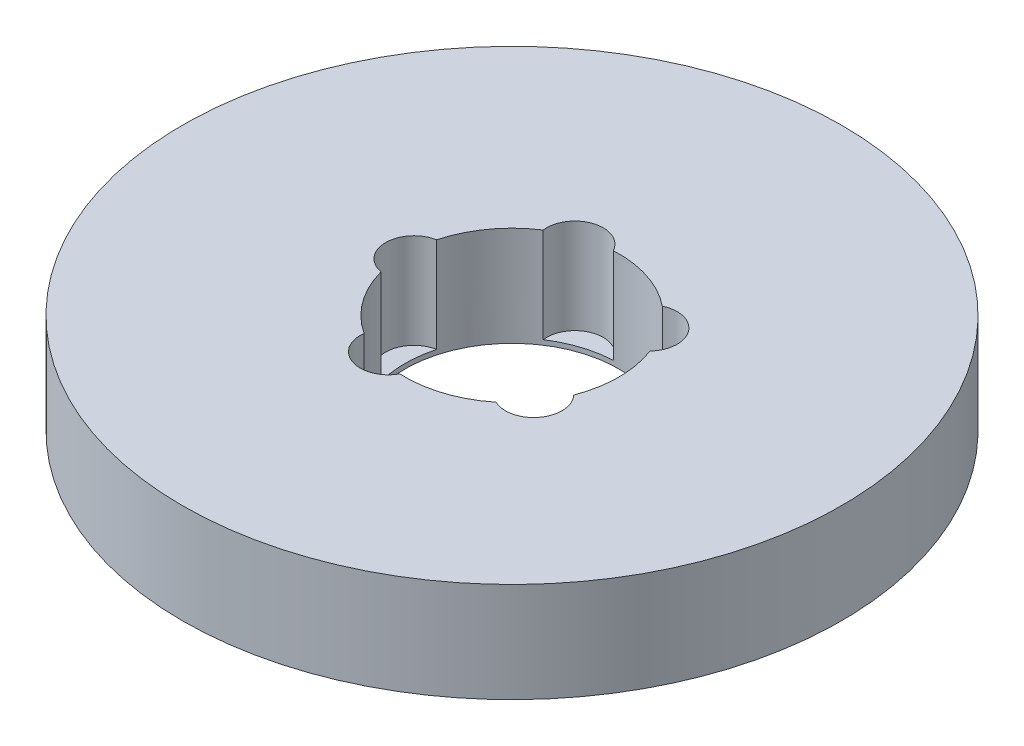
ISO-10303-21;
HEADER;
FILE_DESCRIPTION(('STEP AP214'),'2;1');
FILE_NAME('part.step','',(''),(''),'','','');
FILE_SCHEMA(('AUTOMOTIVE_DESIGN { 1 0 10303 214 1 1 1 1 }'));
ENDSEC;
DATA;
#1=APPLICATION_CONTEXT('core data for automotive mechanical design processes');
#2=APPLICATION_PROTOCOL_DEFINITION('international standard','automotive_design',2000,#1);
#3=PRODUCT_CONTEXT('',#1,'mechanical');
#4=PRODUCT('Part','Part','',(#3));
#5=PRODUCT_RELATED_PRODUCT_CATEGORY('part','',(#4));
#6=PRODUCT_DEFINITION_FORMATION('','',#4);
#7=PRODUCT_DEFINITION_CONTEXT('part definition',#1,'design');
#8=PRODUCT_DEFINITION('design','',#6,#7);
#9=PRODUCT_DEFINITION_SHAPE('','',#8);
#10=(LENGTH_UNIT() NAMED_UNIT(*) SI_UNIT(.MILLI.,.METRE.));
#11=(NAMED_UNIT(*) PLANE_ANGLE_UNIT() SI_UNIT($,.RADIAN.));
#12=(NAMED_UNIT(*) SI_UNIT($,.STERADIAN.) SOLID_ANGLE_UNIT());
#13=UNCERTAINTY_MEASURE_WITH_UNIT(LENGTH_MEASURE(1.E-05),#10,'distance_accuracy_value','');
#14=(GEOMETRIC_REPRESENTATION_CONTEXT(3) GLOBAL_UNCERTAINTY_ASSIGNED_CONTEXT((#13)) GLOBAL_UNIT_ASSIGNED_CONTEXT((#10,
#11,#12)) REPRESENTATION_CONTEXT('',''));
#15=CARTESIAN_POINT('',(0.,0.,0.));
#16=DIRECTION('',(0.,0.,1.));
#17=DIRECTION('',(1.,0.,0.));
#18=AXIS2_PLACEMENT_3D('',#15,#16,#17);
#19=CARTESIAN_POINT('',(0.,28.,0.));
#20=DIRECTION('',(0.,-1.,0.));
#21=DIRECTION('',(0.,0.,-1.));
#22=AXIS2_PLACEMENT_3D('',#19,#20,#21);
#23=CYLINDRICAL_SURFACE('',#22,92.5);
#24=CARTESIAN_POINT('',(0.,28.,0.));
#25=DIRECTION('',(0.,1.,0.));
#26=DIRECTION('',(0.,0.,1.));
#27=AXIS2_PLACEMENT_3D('',#24,#25,#26);
#28=CIRCLE('',#27,92.5);
#29=CARTESIAN_POINT('',(0.,28.,92.5));
#30=VERTEX_POINT('',#29);
#31=EDGE_CURVE('E151',#30,#30,#28,.T.);
#32=ORIENTED_EDGE('',*,*,#31,.F.);
#33=EDGE_LOOP('',(#32));
#34=FACE_BOUND('',#33,.T.);
#35=CARTESIAN_POINT('',(0.,0.,0.));
#36=DIRECTION('',(0.,1.,0.));
#37=DIRECTION('',(0.,0.,1.));
#38=AXIS2_PLACEMENT_3D('',#35,#36,#37);
#39=CIRCLE('',#38,92.5);
#40=CARTESIAN_POINT('',(0.,0.,92.5));
#41=VERTEX_POINT('',#40);
#42=EDGE_CURVE('E150',#41,#41,#39,.T.);
#43=ORIENTED_EDGE('',*,*,#42,.T.);
#44=EDGE_LOOP('',(#43));
#45=FACE_BOUND('',#44,.T.);
#46=ADVANCED_FACE('F39',(#34,#45),#23,.T.);
#47=CARTESIAN_POINT('',(0.,28.,0.));
#48=DIRECTION('',(0.,1.,0.));
#49=DIRECTION('',(0.,0.,1.));
#50=AXIS2_PLACEMENT_3D('',#47,#48,#49);
#51=PLANE('',#50);
#52=CARTESIAN_POINT('',(-8.50118758878569,28.,-26.1639650884433));
#53=DIRECTION('',(0.,1.,0.));
#54=DIRECTION('',(-0.95105651629515,0.,0.309016994374958));
#55=AXIS2_PLACEMENT_3D('',#52,#53,#54);
#56=CIRCLE('',#55,7.94232106861222);
#57=CARTESIAN_POINT('',(-1.525406769739,28.,-29.9611938044337));
#58=VERTEX_POINT('',#57);
#59=CARTESIAN_POINT('',(-16.3766678592699,28.,-25.1357265625475));
#60=VERTEX_POINT('',#59);
#61=EDGE_CURVE('E196',#58,#60,#56,.T.);
#62=ORIENTED_EDGE('',*,*,#61,.F.);
#63=CARTESIAN_POINT('',(0.,28.,0.));
#64=DIRECTION('',(0.,1.,0.));
#65=DIRECTION('',(0.,0.,1.));
#66=AXIS2_PLACEMENT_3D('',#63,#64,#65);
#67=CIRCLE('',#66,30.);
#68=CARTESIAN_POINT('',(18.8448278593757,28.,-23.3425033565489));
#69=VERTEX_POINT('',#68);
#70=EDGE_CURVE('E156',#69,#58,#67,.T.);
#71=ORIENTED_EDGE('',*,*,#70,.F.);
#72=CARTESIAN_POINT('',(22.2563980521788,28.,-16.1702197051239));
#73=DIRECTION('',(0.,1.,0.));
#74=DIRECTION('',(-0.58778525229248,0.,-0.809016994374942));
#75=AXIS2_PLACEMENT_3D('',#72,#73,#74);
#76=CIRCLE('',#75,7.94232106861222);
#77=CARTESIAN_POINT('',(28.0234119885047,28.,-10.7092661056923));
#78=VERTEX_POINT('',#77);
#79=EDGE_CURVE('E254',#78,#69,#76,.T.);
#80=ORIENTED_EDGE('',*,*,#79,.F.);
#81=CARTESIAN_POINT('',(28.0234119885049,28.,10.7092661056919));
#82=VERTEX_POINT('',#81);
#83=EDGE_CURVE('E153',#82,#78,#67,.T.);
#84=ORIENTED_EDGE('',*,*,#83,.F.);
#85=CARTESIAN_POINT('',(22.256398052179,28.,16.1702197051236));
#86=DIRECTION('',(0.,1.,0.));
#87=DIRECTION('',(0.587785252292469,0.,-0.809016994374951));
#88=AXIS2_PLACEMENT_3D('',#85,#86,#87);
#89=CIRCLE('',#88,7.94232106861222);
#90=CARTESIAN_POINT('',(18.844827859376,28.,23.3425033565487));
#91=VERTEX_POINT('',#90);
#92=EDGE_CURVE('E248',#91,#82,#89,.T.);
#93=ORIENTED_EDGE('',*,*,#92,.F.);
#94=CARTESIAN_POINT('',(-1.52540676973857,28.,29.9611938044337));
#95=VERTEX_POINT('',#94);
#96=EDGE_CURVE('E140',#95,#91,#67,.T.);
#97=ORIENTED_EDGE('',*,*,#96,.F.);
#98=CARTESIAN_POINT('',(-8.50118758878532,28.,26.1639650884434));
#99=DIRECTION('',(0.,1.,0.));
#100=DIRECTION('',(0.951056516295155,0.,0.309016994374945));
#101=AXIS2_PLACEMENT_3D('',#98,#99,#100);
#102=CIRCLE('',#101,7.94232106861222);
#103=CARTESIAN_POINT('',(-16.3766678592695,28.,25.1357265625478));
#104=VERTEX_POINT('',#103);
#105=EDGE_CURVE('E117',#104,#95,#102,.T.);
#106=ORIENTED_EDGE('',*,*,#105,.F.);
#107=CARTESIAN_POINT('',(-28.9661652188725,28.,7.8077700089707));
#108=VERTEX_POINT('',#107);
#109=EDGE_CURVE('E133',#108,#104,#67,.T.);
#110=ORIENTED_EDGE('',*,*,#109,.F.);
#111=CARTESIAN_POINT('',(-27.5104209267871,28.,0.));
#112=DIRECTION('',(0.,1.,0.));
#113=DIRECTION('',(0.,0.,1.));
#114=AXIS2_PLACEMENT_3D('',#111,#112,#113);
#115=CIRCLE('',#114,7.94232106861222);
#116=CARTESIAN_POINT('',(-28.9661652188725,28.,-7.8077700089707));
#117=VERTEX_POINT('',#116);
#118=EDGE_CURVE('E170',#117,#108,#115,.T.);
#119=ORIENTED_EDGE('',*,*,#118,.F.);
#120=EDGE_CURVE('E149',#60,#117,#67,.T.);
#121=ORIENTED_EDGE('',*,*,#120,.F.);
#122=EDGE_LOOP('',(#62,#71,#80,#84,#93,#97,#106,#110,#119,#121));
#123=FACE_BOUND('',#122,.T.);
#124=ORIENTED_EDGE('',*,*,#31,.T.);
#125=EDGE_LOOP('',(#124));
#126=FACE_BOUND('',#125,.T.);
#127=ADVANCED_FACE('F131',(#123,#126),#51,.T.);
#128=CARTESIAN_POINT('',(0.,0.,0.));
#129=DIRECTION('',(0.,1.,0.));
#130=DIRECTION('',(0.,0.,1.));
#131=AXIS2_PLACEMENT_3D('',#128,#129,#130);
#132=PLANE('',#131);
#133=CARTESIAN_POINT('',(0.,0.,0.));
#134=DIRECTION('',(0.,1.,0.));
#135=DIRECTION('',(0.,0.,1.));
#136=AXIS2_PLACEMENT_3D('',#133,#134,#135);
#137=CIRCLE('',#136,30.);
#138=CARTESIAN_POINT('',(0.,0.,30.));
#139=VERTEX_POINT('',#138);
#140=EDGE_CURVE('E160',#139,#139,#137,.T.);
#141=ORIENTED_EDGE('',*,*,#140,.T.);
#142=EDGE_LOOP('',(#141));
#143=FACE_BOUND('',#142,.T.);
#144=ORIENTED_EDGE('',*,*,#42,.F.);
#145=EDGE_LOOP('',(#144));
#146=FACE_BOUND('',#145,.T.);
#147=ADVANCED_FACE('F212',(#143,#146),#132,.F.);
#148=CARTESIAN_POINT('',(0.,28.,0.));
#149=DIRECTION('',(0.,-1.,0.));
#150=DIRECTION('',(0.,0.,-1.));
#151=AXIS2_PLACEMENT_3D('',#148,#149,#150);
#152=CYLINDRICAL_SURFACE('',#151,30.);
#153=DIRECTION('',(0.,1.,0.));
#154=VECTOR('',#153,1.);
#155=CARTESIAN_POINT('',(-1.52540676973899,14.6760229333202,-29.9611938044337));
#156=LINE('',#155,#154);
#157=CARTESIAN_POINT('',(-1.525406769739,1.35204586664049,-29.9611938044337));
#158=VERTEX_POINT('',#157);
#159=EDGE_CURVE('E11',#158,#58,#156,.T.);
#160=ORIENTED_EDGE('',*,*,#159,.F.);
#161=CARTESIAN_POINT('',(0.,1.35204586664049,0.));
#162=DIRECTION('',(0.,1.,0.));
#163=DIRECTION('',(0.,0.,1.));
#164=AXIS2_PLACEMENT_3D('',#161,#162,#163);
#165=CIRCLE('',#164,30.);
#166=CARTESIAN_POINT('',(-16.3766678592699,1.35204586664049,-25.1357265625475));
#167=VERTEX_POINT('',#166);
#168=EDGE_CURVE('E193',#158,#167,#165,.T.);
#169=ORIENTED_EDGE('',*,*,#168,.T.);
#170=DIRECTION('',(0.,1.,0.));
#171=VECTOR('',#170,1.);
#172=CARTESIAN_POINT('',(-16.3766678592699,14.6760229333202,-25.1357265625475));
#173=LINE('',#172,#171);
#174=EDGE_CURVE('E46',#60,#167,#173,.F.);
#175=ORIENTED_EDGE('',*,*,#174,.F.);
#176=ORIENTED_EDGE('',*,*,#120,.T.);
#177=DIRECTION('',(0.,1.,0.));
#178=VECTOR('',#177,1.);
#179=CARTESIAN_POINT('',(-28.9661652188725,14.6760229333202,-7.8077700089707));
#180=LINE('',#179,#178);
#181=CARTESIAN_POINT('',(-28.9661652188725,1.35204586664049,-7.8077700089707));
#182=VERTEX_POINT('',#181);
#183=EDGE_CURVE('E174',#182,#117,#180,.T.);
#184=ORIENTED_EDGE('',*,*,#183,.F.);
#185=CARTESIAN_POINT('',(0.,1.35204586664049,0.));
#186=DIRECTION('',(0.,1.,0.));
#187=DIRECTION('',(0.,0.,1.));
#188=AXIS2_PLACEMENT_3D('',#185,#186,#187);
#189=CIRCLE('',#188,30.);
#190=CARTESIAN_POINT('',(-28.9661652188725,1.35204586664049,7.8077700089707));
#191=VERTEX_POINT('',#190);
#192=EDGE_CURVE('E171',#182,#191,#189,.T.);
#193=ORIENTED_EDGE('',*,*,#192,.T.);
#194=DIRECTION('',(0.,1.,0.));
#195=VECTOR('',#194,1.);
#196=CARTESIAN_POINT('',(-28.9661652188725,14.6760229333202,7.8077700089707));
#197=LINE('',#196,#195);
#198=EDGE_CURVE('E148',#108,#191,#197,.F.);
#199=ORIENTED_EDGE('',*,*,#198,.F.);
#200=ORIENTED_EDGE('',*,*,#109,.T.);
#201=DIRECTION('',(0.,1.,0.));
#202=VECTOR('',#201,1.);
#203=CARTESIAN_POINT('',(-16.3766678592695,14.6760229333202,25.1357265625478));
#204=LINE('',#203,#202);
#205=CARTESIAN_POINT('',(-16.3766678592695,1.35204586664049,25.1357265625478));
#206=VERTEX_POINT('',#205);
#207=EDGE_CURVE('E111',#206,#104,#204,.T.);
#208=ORIENTED_EDGE('',*,*,#207,.F.);
#209=CARTESIAN_POINT('',(0.,1.35204586664049,0.));
#210=DIRECTION('',(0.,1.,0.));
#211=DIRECTION('',(0.,0.,1.));
#212=AXIS2_PLACEMENT_3D('',#209,#210,#211);
#213=CIRCLE('',#212,30.);
#214=CARTESIAN_POINT('',(-1.52540676973857,1.35204586664049,29.9611938044337));
#215=VERTEX_POINT('',#214);
#216=EDGE_CURVE('E180',#206,#215,#213,.T.);
#217=ORIENTED_EDGE('',*,*,#216,.T.);
#218=DIRECTION('',(0.,1.,0.));
#219=VECTOR('',#218,1.);
#220=CARTESIAN_POINT('',(-1.52540676973857,14.6760229333202,29.9611938044337));
#221=LINE('',#220,#219);
#222=EDGE_CURVE('E124',#95,#215,#221,.F.);
#223=ORIENTED_EDGE('',*,*,#222,.F.);
#224=ORIENTED_EDGE('',*,*,#96,.T.);
#225=DIRECTION('',(0.,1.,0.));
#226=VECTOR('',#225,1.);
#227=CARTESIAN_POINT('',(18.844827859376,14.6760229333202,23.3425033565487));
#228=LINE('',#227,#226);
#229=CARTESIAN_POINT('',(18.844827859376,1.35204586664049,23.3425033565487));
#230=VERTEX_POINT('',#229);
#231=EDGE_CURVE('E183',#230,#91,#228,.T.);
#232=ORIENTED_EDGE('',*,*,#231,.F.);
#233=CARTESIAN_POINT('',(0.,1.35204586664049,0.));
#234=DIRECTION('',(0.,1.,0.));
#235=DIRECTION('',(0.,0.,1.));
#236=AXIS2_PLACEMENT_3D('',#233,#234,#235);
#237=CIRCLE('',#236,30.);
#238=CARTESIAN_POINT('',(28.0234119885049,1.35204586664049,10.7092661056919));
#239=VERTEX_POINT('',#238);
#240=EDGE_CURVE('E123',#230,#239,#237,.T.);
#241=ORIENTED_EDGE('',*,*,#240,.T.);
#242=DIRECTION('',(0.,1.,0.));
#243=VECTOR('',#242,1.);
#244=CARTESIAN_POINT('',(28.0234119885049,14.6760229333202,10.7092661056919));
#245=LINE('',#244,#243);
#246=EDGE_CURVE('E185',#82,#239,#245,.F.);
#247=ORIENTED_EDGE('',*,*,#246,.F.);
#248=ORIENTED_EDGE('',*,*,#83,.T.);
#249=DIRECTION('',(0.,1.,0.));
#250=VECTOR('',#249,1.);
#251=CARTESIAN_POINT('',(28.0234119885047,14.6760229333202,-10.7092661056923));
#252=LINE('',#251,#250);
#253=CARTESIAN_POINT('',(28.0234119885047,1.35204586664049,-10.7092661056923));
#254=VERTEX_POINT('',#253);
#255=EDGE_CURVE('E195',#254,#78,#252,.T.);
#256=ORIENTED_EDGE('',*,*,#255,.F.);
#257=CARTESIAN_POINT('',(0.,1.35204586664049,0.));
#258=DIRECTION('',(0.,1.,0.));
#259=DIRECTION('',(0.,0.,1.));
#260=AXIS2_PLACEMENT_3D('',#257,#258,#259);
#261=CIRCLE('',#260,30.);
#262=CARTESIAN_POINT('',(18.8448278593757,1.35204586664049,-23.3425033565489));
#263=VERTEX_POINT('',#262);
#264=EDGE_CURVE('E190',#254,#263,#261,.T.);
#265=ORIENTED_EDGE('',*,*,#264,.T.);
#266=DIRECTION('',(0.,1.,0.));
#267=VECTOR('',#266,1.);
#268=CARTESIAN_POINT('',(18.8448278593757,14.6760229333202,-23.3425033565489));
#269=LINE('',#268,#267);
#270=EDGE_CURVE('E189',#69,#263,#269,.F.);
#271=ORIENTED_EDGE('',*,*,#270,.F.);
#272=ORIENTED_EDGE('',*,*,#70,.T.);
#273=EDGE_LOOP('',(#160,#169,#175,#176,#184,#193,#199,#200,#208,#217,#223,#224,#232,#241,#247,
#248,#256,#265,#271,#272));
#274=FACE_BOUND('',#273,.T.);
#275=ORIENTED_EDGE('',*,*,#140,.F.);
#276=EDGE_LOOP('',(#275));
#277=FACE_BOUND('',#276,.T.);
#278=ADVANCED_FACE('F142',(#274,#277),#152,.F.);
#279=CARTESIAN_POINT('',(-27.5104209267871,1.35204586664049,0.));
#280=DIRECTION('',(0.,1.,0.));
#281=DIRECTION('',(0.,0.,1.));
#282=AXIS2_PLACEMENT_3D('',#279,#280,#281);
#283=CYLINDRICAL_SURFACE('',#282,7.94232106861222);
#284=ORIENTED_EDGE('',*,*,#183,.T.);
#285=ORIENTED_EDGE('',*,*,#118,.T.);
#286=ORIENTED_EDGE('',*,*,#198,.T.);
#287=CARTESIAN_POINT('',(-27.5104209267871,1.35204586664049,0.));
#288=DIRECTION('',(0.,1.,0.));
#289=DIRECTION('',(0.,0.,1.));
#290=AXIS2_PLACEMENT_3D('',#287,#288,#289);
#291=CIRCLE('',#290,7.94232106861222);
#292=EDGE_CURVE('E163',#182,#191,#291,.T.);
#293=ORIENTED_EDGE('',*,*,#292,.F.);
#294=EDGE_LOOP('',(#284,#285,#286,#293));
#295=FACE_BOUND('',#294,.T.);
#296=ADVANCED_FACE('F221',(#295),#283,.F.);
#297=CARTESIAN_POINT('',(-27.5104209267871,1.35204586664049,0.));
#298=DIRECTION('',(0.,1.,0.));
#299=DIRECTION('',(0.,0.,1.));
#300=AXIS2_PLACEMENT_3D('',#297,#298,#299);
#301=PLANE('',#300);
#302=ORIENTED_EDGE('',*,*,#292,.T.);
#303=ORIENTED_EDGE('',*,*,#192,.F.);
#304=EDGE_LOOP('',(#302,#303));
#305=FACE_BOUND('',#304,.T.);
#306=ADVANCED_FACE('F227',(#305),#301,.T.);
#307=CARTESIAN_POINT('',(-8.50118758878532,1.35204586664049,26.1639650884434));
#308=DIRECTION('',(0.,1.,0.));
#309=DIRECTION('',(0.,0.,1.));
#310=AXIS2_PLACEMENT_3D('',#307,#308,#309);
#311=CYLINDRICAL_SURFACE('',#310,7.94232106861222);
#312=ORIENTED_EDGE('',*,*,#207,.T.);
#313=ORIENTED_EDGE('',*,*,#105,.T.);
#314=ORIENTED_EDGE('',*,*,#222,.T.);
#315=CARTESIAN_POINT('',(-8.50118758878532,1.35204586664049,26.1639650884434));
#316=DIRECTION('',(0.,1.,0.));
#317=DIRECTION('',(0.951056516295155,0.,0.309016994374945));
#318=AXIS2_PLACEMENT_3D('',#315,#316,#317);
#319=CIRCLE('',#318,7.94232106861222);
#320=EDGE_CURVE('E119',#206,#215,#319,.T.);
#321=ORIENTED_EDGE('',*,*,#320,.F.);
#322=EDGE_LOOP('',(#312,#313,#314,#321));
#323=FACE_BOUND('',#322,.T.);
#324=ADVANCED_FACE('F116',(#323),#311,.F.);
#325=CARTESIAN_POINT('',(-8.50118758878532,1.35204586664049,26.1639650884434));
#326=DIRECTION('',(0.,1.,0.));
#327=DIRECTION('',(0.951056516295155,0.,0.309016994374945));
#328=AXIS2_PLACEMENT_3D('',#325,#326,#327);
#329=PLANE('',#328);
#330=ORIENTED_EDGE('',*,*,#320,.T.);
#331=ORIENTED_EDGE('',*,*,#216,.F.);
#332=EDGE_LOOP('',(#330,#331));
#333=FACE_BOUND('',#332,.T.);
#334=ADVANCED_FACE('F234',(#333),#329,.T.);
#335=CARTESIAN_POINT('',(22.256398052179,1.35204586664049,16.1702197051236));
#336=DIRECTION('',(0.,1.,0.));
#337=DIRECTION('',(0.,0.,1.));
#338=AXIS2_PLACEMENT_3D('',#335,#336,#337);
#339=CYLINDRICAL_SURFACE('',#338,7.94232106861222);
#340=ORIENTED_EDGE('',*,*,#231,.T.);
#341=ORIENTED_EDGE('',*,*,#92,.T.);
#342=ORIENTED_EDGE('',*,*,#246,.T.);
#343=CARTESIAN_POINT('',(22.256398052179,1.35204586664049,16.1702197051236));
#344=DIRECTION('',(0.,1.,0.));
#345=DIRECTION('',(0.587785252292469,0.,-0.809016994374951));
#346=AXIS2_PLACEMENT_3D('',#343,#344,#345);
#347=CIRCLE('',#346,7.94232106861222);
#348=EDGE_CURVE('E137',#230,#239,#347,.T.);
#349=ORIENTED_EDGE('',*,*,#348,.F.);
#350=EDGE_LOOP('',(#340,#341,#342,#349));
#351=FACE_BOUND('',#350,.T.);
#352=ADVANCED_FACE('F240',(#351),#339,.F.);
#353=CARTESIAN_POINT('',(22.256398052179,1.35204586664049,16.1702197051236));
#354=DIRECTION('',(0.,1.,0.));
#355=DIRECTION('',(0.587785252292469,0.,-0.809016994374951));
#356=AXIS2_PLACEMENT_3D('',#353,#354,#355);
#357=PLANE('',#356);
#358=ORIENTED_EDGE('',*,*,#348,.T.);
#359=ORIENTED_EDGE('',*,*,#240,.F.);
#360=EDGE_LOOP('',(#358,#359));
#361=FACE_BOUND('',#360,.T.);
#362=ADVANCED_FACE('F245',(#361),#357,.T.);
#363=CARTESIAN_POINT('',(22.2563980521788,1.35204586664049,-16.1702197051239));
#364=DIRECTION('',(0.,1.,0.));
#365=DIRECTION('',(0.,0.,1.));
#366=AXIS2_PLACEMENT_3D('',#363,#364,#365);
#367=CYLINDRICAL_SURFACE('',#366,7.94232106861222);
#368=ORIENTED_EDGE('',*,*,#255,.T.);
#369=ORIENTED_EDGE('',*,*,#79,.T.);
#370=ORIENTED_EDGE('',*,*,#270,.T.);
#371=CARTESIAN_POINT('',(22.2563980521788,1.35204586664049,-16.1702197051239));
#372=DIRECTION('',(0.,1.,0.));
#373=DIRECTION('',(-0.58778525229248,0.,-0.809016994374942));
#374=AXIS2_PLACEMENT_3D('',#371,#372,#373);
#375=CIRCLE('',#374,7.94232106861222);
#376=EDGE_CURVE('E56',#254,#263,#375,.T.);
#377=ORIENTED_EDGE('',*,*,#376,.F.);
#378=EDGE_LOOP('',(#368,#369,#370,#377));
#379=FACE_BOUND('',#378,.T.);
#380=ADVANCED_FACE('F264',(#379),#367,.F.);
#381=CARTESIAN_POINT('',(22.2563980521788,1.35204586664049,-16.1702197051239));
#382=DIRECTION('',(0.,1.,0.));
#383=DIRECTION('',(-0.58778525229248,0.,-0.809016994374942));
#384=AXIS2_PLACEMENT_3D('',#381,#382,#383);
#385=PLANE('',#384);
#386=ORIENTED_EDGE('',*,*,#376,.T.);
#387=ORIENTED_EDGE('',*,*,#264,.F.);
#388=EDGE_LOOP('',(#386,#387));
#389=FACE_BOUND('',#388,.T.);
#390=ADVANCED_FACE('F202',(#389),#385,.T.);
#391=CARTESIAN_POINT('',(-8.50118758878569,1.35204586664049,-26.1639650884433));
#392=DIRECTION('',(0.,1.,0.));
#393=DIRECTION('',(0.,0.,1.));
#394=AXIS2_PLACEMENT_3D('',#391,#392,#393);
#395=CYLINDRICAL_SURFACE('',#394,7.94232106861222);
#396=ORIENTED_EDGE('',*,*,#159,.T.);
#397=ORIENTED_EDGE('',*,*,#61,.T.);
#398=ORIENTED_EDGE('',*,*,#174,.T.);
#399=CARTESIAN_POINT('',(-8.50118758878569,1.35204586664049,-26.1639650884433));
#400=DIRECTION('',(0.,1.,0.));
#401=DIRECTION('',(-0.95105651629515,0.,0.309016994374958));
#402=AXIS2_PLACEMENT_3D('',#399,#400,#401);
#403=CIRCLE('',#402,7.94232106861222);
#404=EDGE_CURVE('E55',#158,#167,#403,.T.);
#405=ORIENTED_EDGE('',*,*,#404,.F.);
#406=EDGE_LOOP('',(#396,#397,#398,#405));
#407=FACE_BOUND('',#406,.T.);
#408=ADVANCED_FACE('F197',(#407),#395,.F.);
#409=CARTESIAN_POINT('',(-8.50118758878569,1.35204586664049,-26.1639650884433));
#410=DIRECTION('',(0.,1.,0.));
#411=DIRECTION('',(-0.95105651629515,0.,0.309016994374958));
#412=AXIS2_PLACEMENT_3D('',#409,#410,#411);
#413=PLANE('',#412);
#414=ORIENTED_EDGE('',*,*,#404,.T.);
#415=ORIENTED_EDGE('',*,*,#168,.F.);
#416=EDGE_LOOP('',(#414,#415));
#417=FACE_BOUND('',#416,.T.);
#418=ADVANCED_FACE('F200',(#417),#413,.T.);
#419=CLOSED_SHELL('',(#46,#127,#147,#278,#296,#306,#324,#334,#352,#362,#380,#390,#408,#418));
#420=MANIFOLD_SOLID_BREP('B2',#419);
#421=ADVANCED_BREP_SHAPE_REPRESENTATION('',(#18,#420),#14);
#422=SHAPE_DEFINITION_REPRESENTATION(#9,#421);
ENDSEC;
END-ISO-10303-21;
